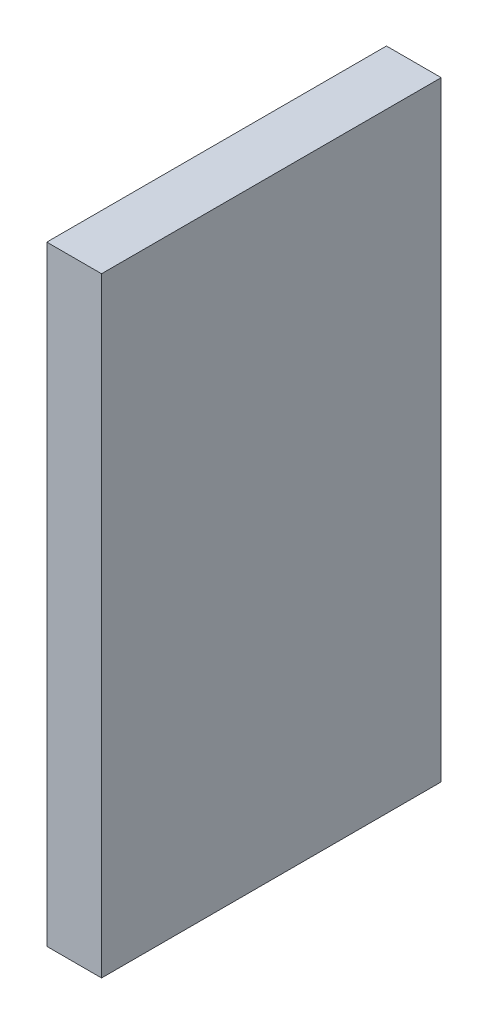
ISO-10303-21;
HEADER;
FILE_DESCRIPTION(('STEP AP214'),'2;1');
FILE_NAME('part.step','',(''),(''),'','','');
FILE_SCHEMA(('AUTOMOTIVE_DESIGN { 1 0 10303 214 1 1 1 1 }'));
ENDSEC;
DATA;
#1=APPLICATION_CONTEXT('core data for automotive mechanical design processes');
#2=APPLICATION_PROTOCOL_DEFINITION('international standard','automotive_design',2000,#1);
#3=PRODUCT_CONTEXT('',#1,'mechanical');
#4=PRODUCT('Part','Part','',(#3));
#5=PRODUCT_RELATED_PRODUCT_CATEGORY('part','',(#4));
#6=PRODUCT_DEFINITION_FORMATION('','',#4);
#7=PRODUCT_DEFINITION_CONTEXT('part definition',#1,'design');
#8=PRODUCT_DEFINITION('design','',#6,#7);
#9=PRODUCT_DEFINITION_SHAPE('','',#8);
#10=(LENGTH_UNIT() NAMED_UNIT(*) SI_UNIT(.MILLI.,.METRE.));
#11=(NAMED_UNIT(*) PLANE_ANGLE_UNIT() SI_UNIT($,.RADIAN.));
#12=(NAMED_UNIT(*) SI_UNIT($,.STERADIAN.) SOLID_ANGLE_UNIT());
#13=UNCERTAINTY_MEASURE_WITH_UNIT(LENGTH_MEASURE(1.E-05),#10,'distance_accuracy_value','');
#14=(GEOMETRIC_REPRESENTATION_CONTEXT(3) GLOBAL_UNCERTAINTY_ASSIGNED_CONTEXT((#13)) GLOBAL_UNIT_ASSIGNED_CONTEXT((#10,
#11,#12)) REPRESENTATION_CONTEXT('',''));
#15=CARTESIAN_POINT('',(0.,0.,0.));
#16=DIRECTION('',(0.,0.,1.));
#17=DIRECTION('',(1.,0.,0.));
#18=AXIS2_PLACEMENT_3D('',#15,#16,#17);
#19=CARTESIAN_POINT('',(3.,8.74523828772378,7.27242023390867));
#20=DIRECTION('',(0.,-1.,0.));
#21=DIRECTION('',(0.,0.,-1.));
#22=AXIS2_PLACEMENT_3D('',#19,#20,#21);
#23=PLANE('',#22);
#24=DIRECTION('',(0.,0.,1.));
#25=VECTOR('',#24,1.);
#26=CARTESIAN_POINT('',(0.,8.74523828772378,7.27242023390867));
#27=LINE('',#26,#25);
#28=CARTESIAN_POINT('',(0.,8.74523828772378,7.27242023390867));
#29=VERTEX_POINT('',#28);
#30=CARTESIAN_POINT('',(0.,8.74523828772378,25.8724202339087));
#31=VERTEX_POINT('',#30);
#32=EDGE_CURVE('E96',#29,#31,#27,.T.);
#33=ORIENTED_EDGE('',*,*,#32,.T.);
#34=DIRECTION('',(-1.,0.,0.));
#35=VECTOR('',#34,1.);
#36=CARTESIAN_POINT('',(3.,8.74523828772378,25.8724202339087));
#37=LINE('',#36,#35);
#38=CARTESIAN_POINT('',(3.,8.74523828772378,25.8724202339087));
#39=VERTEX_POINT('',#38);
#40=EDGE_CURVE('E11',#39,#31,#37,.T.);
#41=ORIENTED_EDGE('',*,*,#40,.F.);
#42=DIRECTION('',(0.,0.,1.));
#43=VECTOR('',#42,1.);
#44=CARTESIAN_POINT('',(3.,8.74523828772378,7.27242023390867));
#45=LINE('',#44,#43);
#46=CARTESIAN_POINT('',(3.,8.74523828772378,7.27242023390867));
#47=VERTEX_POINT('',#46);
#48=EDGE_CURVE('E84',#47,#39,#45,.T.);
#49=ORIENTED_EDGE('',*,*,#48,.F.);
#50=DIRECTION('',(-1.,0.,0.));
#51=VECTOR('',#50,1.);
#52=CARTESIAN_POINT('',(3.,8.74523828772378,7.27242023390867));
#53=LINE('',#52,#51);
#54=EDGE_CURVE('E92',#47,#29,#53,.T.);
#55=ORIENTED_EDGE('',*,*,#54,.T.);
#56=EDGE_LOOP('',(#33,#41,#49,#55));
#57=FACE_BOUND('',#56,.T.);
#58=ADVANCED_FACE('F33',(#57),#23,.F.);
#59=CARTESIAN_POINT('',(3.,8.74523828772378,25.8724202339087));
#60=DIRECTION('',(0.,0.,-1.));
#61=DIRECTION('',(-1.,0.,0.));
#62=AXIS2_PLACEMENT_3D('',#59,#60,#61);
#63=PLANE('',#62);
#64=DIRECTION('',(0.,-1.,0.));
#65=VECTOR('',#64,1.);
#66=CARTESIAN_POINT('',(0.,8.74523828772378,25.8724202339087));
#67=LINE('',#66,#65);
#68=CARTESIAN_POINT('',(0.,-24.6547617122762,25.8724202339087));
#69=VERTEX_POINT('',#68);
#70=EDGE_CURVE('E88',#31,#69,#67,.T.);
#71=ORIENTED_EDGE('',*,*,#70,.T.);
#72=DIRECTION('',(-1.,0.,0.));
#73=VECTOR('',#72,1.);
#74=CARTESIAN_POINT('',(3.,-24.6547617122762,25.8724202339087));
#75=LINE('',#74,#73);
#76=CARTESIAN_POINT('',(3.,-24.6547617122762,25.8724202339087));
#77=VERTEX_POINT('',#76);
#78=EDGE_CURVE('E41',#77,#69,#75,.T.);
#79=ORIENTED_EDGE('',*,*,#78,.F.);
#80=DIRECTION('',(0.,-1.,0.));
#81=VECTOR('',#80,1.);
#82=CARTESIAN_POINT('',(3.,8.74523828772378,25.8724202339087));
#83=LINE('',#82,#81);
#84=EDGE_CURVE('E79',#39,#77,#83,.T.);
#85=ORIENTED_EDGE('',*,*,#84,.F.);
#86=ORIENTED_EDGE('',*,*,#40,.T.);
#87=EDGE_LOOP('',(#71,#79,#85,#86));
#88=FACE_BOUND('',#87,.T.);
#89=ADVANCED_FACE('F87',(#88),#63,.F.);
#90=CARTESIAN_POINT('',(3.,-24.6547617122762,25.8724202339087));
#91=DIRECTION('',(0.,1.,0.));
#92=DIRECTION('',(0.,0.,1.));
#93=AXIS2_PLACEMENT_3D('',#90,#91,#92);
#94=PLANE('',#93);
#95=DIRECTION('',(0.,0.,-1.));
#96=VECTOR('',#95,1.);
#97=CARTESIAN_POINT('',(0.,-24.6547617122762,25.8724202339087));
#98=LINE('',#97,#96);
#99=CARTESIAN_POINT('',(0.,-24.6547617122762,7.27242023390867));
#100=VERTEX_POINT('',#99);
#101=EDGE_CURVE('E66',#69,#100,#98,.T.);
#102=ORIENTED_EDGE('',*,*,#101,.T.);
#103=DIRECTION('',(-1.,0.,0.));
#104=VECTOR('',#103,1.);
#105=CARTESIAN_POINT('',(3.,-24.6547617122762,7.27242023390867));
#106=LINE('',#105,#104);
#107=CARTESIAN_POINT('',(3.,-24.6547617122762,7.27242023390867));
#108=VERTEX_POINT('',#107);
#109=EDGE_CURVE('E89',#108,#100,#106,.T.);
#110=ORIENTED_EDGE('',*,*,#109,.F.);
#111=DIRECTION('',(0.,0.,-1.));
#112=VECTOR('',#111,1.);
#113=CARTESIAN_POINT('',(3.,-24.6547617122762,25.8724202339087));
#114=LINE('',#113,#112);
#115=EDGE_CURVE('E82',#77,#108,#114,.T.);
#116=ORIENTED_EDGE('',*,*,#115,.F.);
#117=ORIENTED_EDGE('',*,*,#78,.T.);
#118=EDGE_LOOP('',(#102,#110,#116,#117));
#119=FACE_BOUND('',#118,.T.);
#120=ADVANCED_FACE('F90',(#119),#94,.F.);
#121=CARTESIAN_POINT('',(3.,-24.6547617122762,7.27242023390867));
#122=DIRECTION('',(0.,0.,1.));
#123=DIRECTION('',(1.,0.,0.));
#124=AXIS2_PLACEMENT_3D('',#121,#122,#123);
#125=PLANE('',#124);
#126=DIRECTION('',(0.,1.,0.));
#127=VECTOR('',#126,1.);
#128=CARTESIAN_POINT('',(0.,-24.6547617122762,7.27242023390867));
#129=LINE('',#128,#127);
#130=EDGE_CURVE('E72',#100,#29,#129,.T.);
#131=ORIENTED_EDGE('',*,*,#130,.T.);
#132=ORIENTED_EDGE('',*,*,#54,.F.);
#133=DIRECTION('',(0.,1.,0.));
#134=VECTOR('',#133,1.);
#135=CARTESIAN_POINT('',(3.,-24.6547617122762,7.27242023390867));
#136=LINE('',#135,#134);
#137=EDGE_CURVE('E49',#108,#47,#136,.T.);
#138=ORIENTED_EDGE('',*,*,#137,.F.);
#139=ORIENTED_EDGE('',*,*,#109,.T.);
#140=EDGE_LOOP('',(#131,#132,#138,#139));
#141=FACE_BOUND('',#140,.T.);
#142=ADVANCED_FACE('F103',(#141),#125,.F.);
#143=CARTESIAN_POINT('',(3.,0.,0.));
#144=DIRECTION('',(1.,0.,0.));
#145=DIRECTION('',(0.,0.,-1.));
#146=AXIS2_PLACEMENT_3D('',#143,#144,#145);
#147=PLANE('',#146);
#148=ORIENTED_EDGE('',*,*,#48,.T.);
#149=ORIENTED_EDGE('',*,*,#84,.T.);
#150=ORIENTED_EDGE('',*,*,#115,.T.);
#151=ORIENTED_EDGE('',*,*,#137,.T.);
#152=EDGE_LOOP('',(#148,#149,#150,#151));
#153=FACE_BOUND('',#152,.T.);
#154=ADVANCED_FACE('F80',(#153),#147,.T.);
#155=CARTESIAN_POINT('',(0.,0.,0.));
#156=DIRECTION('',(1.,0.,0.));
#157=DIRECTION('',(0.,0.,-1.));
#158=AXIS2_PLACEMENT_3D('',#155,#156,#157);
#159=PLANE('',#158);
#160=ORIENTED_EDGE('',*,*,#32,.F.);
#161=ORIENTED_EDGE('',*,*,#130,.F.);
#162=ORIENTED_EDGE('',*,*,#101,.F.);
#163=ORIENTED_EDGE('',*,*,#70,.F.);
#164=EDGE_LOOP('',(#160,#161,#162,#163));
#165=FACE_BOUND('',#164,.T.);
#166=ADVANCED_FACE('F106',(#165),#159,.F.);
#167=CLOSED_SHELL('',(#58,#89,#120,#142,#154,#166));
#168=MANIFOLD_SOLID_BREP('B2',#167);
#169=ADVANCED_BREP_SHAPE_REPRESENTATION('',(#18,#168),#14);
#170=SHAPE_DEFINITION_REPRESENTATION(#9,#169);
ENDSEC;
END-ISO-10303-21;
